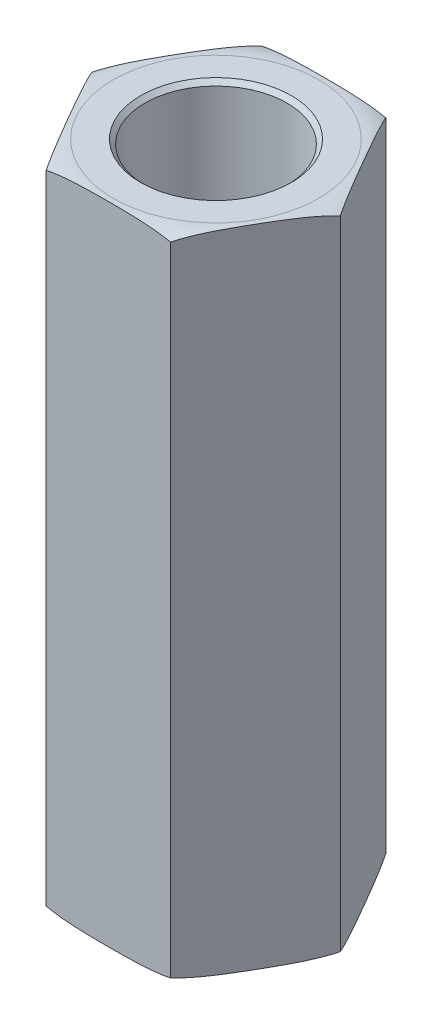
ISO-10303-21;
HEADER;
FILE_DESCRIPTION(('STEP AP214'),'2;1');
FILE_NAME('part.step','',(''),(''),'','','');
FILE_SCHEMA(('AUTOMOTIVE_DESIGN { 1 0 10303 214 1 1 1 1 }'));
ENDSEC;
DATA;
#1=APPLICATION_CONTEXT('core data for automotive mechanical design processes');
#2=APPLICATION_PROTOCOL_DEFINITION('international standard','automotive_design',2000,#1);
#3=PRODUCT_CONTEXT('',#1,'mechanical');
#4=PRODUCT('Part','Part','',(#3));
#5=PRODUCT_RELATED_PRODUCT_CATEGORY('part','',(#4));
#6=PRODUCT_DEFINITION_FORMATION('','',#4);
#7=PRODUCT_DEFINITION_CONTEXT('part definition',#1,'design');
#8=PRODUCT_DEFINITION('design','',#6,#7);
#9=PRODUCT_DEFINITION_SHAPE('','',#8);
#10=(LENGTH_UNIT() NAMED_UNIT(*) SI_UNIT(.MILLI.,.METRE.));
#11=(NAMED_UNIT(*) PLANE_ANGLE_UNIT() SI_UNIT($,.RADIAN.));
#12=(NAMED_UNIT(*) SI_UNIT($,.STERADIAN.) SOLID_ANGLE_UNIT());
#13=UNCERTAINTY_MEASURE_WITH_UNIT(LENGTH_MEASURE(1.E-05),#10,'distance_accuracy_value','');
#14=(GEOMETRIC_REPRESENTATION_CONTEXT(3) GLOBAL_UNCERTAINTY_ASSIGNED_CONTEXT((#13)) GLOBAL_UNIT_ASSIGNED_CONTEXT((#10,
#11,#12)) REPRESENTATION_CONTEXT('',''));
#15=CARTESIAN_POINT('',(0.,0.,0.));
#16=DIRECTION('',(0.,0.,1.));
#17=DIRECTION('',(1.,0.,0.));
#18=AXIS2_PLACEMENT_3D('',#15,#16,#17);
#19=CARTESIAN_POINT('',(3.66617420935412,9.525,0.));
#20=DIRECTION('',(-0.866025403784439,0.,0.5));
#21=DIRECTION('',(0.5,0.,0.866025403784439));
#22=AXIS2_PLACEMENT_3D('',#19,#20,#21);
#23=PLANE('',#22);
#24=CARTESIAN_POINT('',(3.66617420935412,9.398,0.));
#25=CARTESIAN_POINT('',(3.63753042799203,9.40993202468709,-0.0496124846400275));
#26=CARTESIAN_POINT('',(3.60875945805376,9.42055614694223,-0.0994452663561576));
#27=CARTESIAN_POINT('',(3.5510445941875,9.43952869380446,-0.199410342924434));
#28=CARTESIAN_POINT('',(3.52210079717004,9.44787829008084,-0.249542469922636));
#29=CARTESIAN_POINT('',(3.43520914920621,9.47001015084215,-0.400043218949384));
#30=CARTESIAN_POINT('',(3.37708055050429,9.48092253839952,-0.500724905273881));
#31=CARTESIAN_POINT('',(3.26070078255249,9.4975474670846,-0.702300576339476));
#32=CARTESIAN_POINT('',(3.20244972255356,9.50326351393611,-0.803194371852361));
#33=CARTESIAN_POINT('',(3.08586365366197,9.51154325238667,-1.00512736662733));
#34=CARTESIAN_POINT('',(3.02752861562773,9.5141051045623,-1.1061666163641));
#35=CARTESIAN_POINT('',(2.91138213832281,9.5174800878033,-1.30733821617637));
#36=CARTESIAN_POINT('',(2.85357078573453,9.51830898530758,-1.40747041611355));
#37=CARTESIAN_POINT('',(2.73795502274299,9.51890235146376,-1.60772279177072));
#38=CARTESIAN_POINT('',(2.68015061252642,9.51866697200316,-1.70784296716739));
#39=CARTESIAN_POINT('',(2.56452713843041,9.51693398748164,-1.9081086988493));
#40=CARTESIAN_POINT('',(2.50670807591217,9.51543597123025,-2.00825425277689));
#41=CARTESIAN_POINT('',(2.39109525560102,9.51017531674577,-2.20850153156214));
#42=CARTESIAN_POINT('',(2.33330149587798,9.50641290136093,-2.30860325976287));
#43=CARTESIAN_POINT('',(2.23849359853911,9.49698899303816,-2.47281535491256));
#44=CARTESIAN_POINT('',(2.20145192539195,9.49249057663768,-2.5369734148008));
#45=CARTESIAN_POINT('',(2.12747060706785,9.48130148199487,-2.66511281694908));
#46=CARTESIAN_POINT('',(2.09053091530161,9.47461207209161,-2.72909423990413));
#47=CARTESIAN_POINT('',(2.01669860633929,9.45839780386584,-2.85697555026699));
#48=CARTESIAN_POINT('',(1.97980639337021,9.44886525006224,-2.92087473753309));
#49=CARTESIAN_POINT('',(1.90623831426152,9.42626291445617,-3.04829838836459));
#50=CARTESIAN_POINT('',(1.86956287153406,9.41318767878213,-3.11182211855863));
#51=CARTESIAN_POINT('',(1.83308710467706,9.398,-3.175));
#52=B_SPLINE_CURVE_WITH_KNOTS('',3,(#24,#25,#26,#27,#28,#29,#30,#31,#32,#33,#34,#35,#36,#37,#38,
#39,#40,#41,#42,#43,#44,#45,#46,#47,#48,#49,#50,#51),.UNSPECIFIED.,.F.,.F.,(4,2,2,2,2,2,2,2,2,2,
2,2,2,4),(0.,0.17550946738822,0.350928353443244,0.701031261588482,1.05089779629354,
1.40096826525493,1.74783967758031,2.09466158796881,2.44159648808703,2.78849725058543,
3.0111319819994,3.23363806003511,3.45675194236245,3.68021127402553),.UNSPECIFIED.);
#53=CARTESIAN_POINT('',(3.66617420935412,9.398,0.));
#54=VERTEX_POINT('',#53);
#55=CARTESIAN_POINT('',(1.83308710467706,9.398,-3.175));
#56=VERTEX_POINT('',#55);
#57=EDGE_CURVE('E106',#54,#56,#52,.T.);
#58=ORIENTED_EDGE('',*,*,#57,.F.);
#59=DIRECTION('',(0.,1.,0.));
#60=VECTOR('',#59,1.);
#61=CARTESIAN_POINT('',(3.66617420935412,9.525,0.));
#62=LINE('',#61,#60);
#63=CARTESIAN_POINT('',(3.66617420935412,-9.398,0.));
#64=VERTEX_POINT('',#63);
#65=EDGE_CURVE('E79',#54,#64,#62,.F.);
#66=ORIENTED_EDGE('',*,*,#65,.T.);
#67=CARTESIAN_POINT('',(1.83308710467705,-9.398,-3.17500000000001));
#68=CARTESIAN_POINT('',(1.86173088603914,-9.40993202468709,-3.12538751535998));
#69=CARTESIAN_POINT('',(1.89050185597741,-9.42055614694223,-3.07555473364385));
#70=CARTESIAN_POINT('',(1.94821671984367,-9.43952869380445,-2.97558965707558));
#71=CARTESIAN_POINT('',(1.97716051686113,-9.44787829008084,-2.92545753007738));
#72=CARTESIAN_POINT('',(2.06405216482496,-9.47001015084215,-2.77495678105063));
#73=CARTESIAN_POINT('',(2.12218076352687,-9.48092253839952,-2.67427509472614));
#74=CARTESIAN_POINT('',(2.23856053147867,-9.4975474670846,-2.47269942366054));
#75=CARTESIAN_POINT('',(2.2968115914776,-9.50326351393611,-2.37180562814766));
#76=CARTESIAN_POINT('',(2.41339766036919,-9.51154325238667,-2.1698726333727));
#77=CARTESIAN_POINT('',(2.47173269840343,-9.5141051045623,-2.06883338363593));
#78=CARTESIAN_POINT('',(2.58787917570835,-9.5174800878033,-1.86766178382366));
#79=CARTESIAN_POINT('',(2.64569052829663,-9.51830898530758,-1.76752958388648));
#80=CARTESIAN_POINT('',(2.76130629128816,-9.51890235146376,-1.56727720822931));
#81=CARTESIAN_POINT('',(2.81911070150473,-9.51866697200316,-1.46715703283265));
#82=CARTESIAN_POINT('',(2.93473417560074,-9.51693398748165,-1.26689130115074));
#83=CARTESIAN_POINT('',(2.99255323811898,-9.51543597123026,-1.16674574722316));
#84=CARTESIAN_POINT('',(3.10816605843013,-9.51017531674577,-0.966498468437907));
#85=CARTESIAN_POINT('',(3.16595981815317,-9.50641290136093,-0.866396740237176));
#86=CARTESIAN_POINT('',(3.26076771549203,-9.49698899303816,-0.702184645087488));
#87=CARTESIAN_POINT('',(3.2978093886392,-9.49249057663768,-0.63802658519924));
#88=CARTESIAN_POINT('',(3.37179070696331,-9.48130148199488,-0.509887183050958));
#89=CARTESIAN_POINT('',(3.40873039872954,-9.47461207209161,-0.445905760095904));
#90=CARTESIAN_POINT('',(3.48256270769187,-9.45839780386584,-0.318024449733033));
#91=CARTESIAN_POINT('',(3.51945492066095,-9.44886525006225,-0.254125262466928));
#92=CARTESIAN_POINT('',(3.59302299976965,-9.42626291445618,-0.126701611635421));
#93=CARTESIAN_POINT('',(3.62969844249711,-9.41318767878214,-0.0631778814413773));
#94=CARTESIAN_POINT('',(3.66617420935412,-9.398,0.));
#95=B_SPLINE_CURVE_WITH_KNOTS('',3,(#67,#68,#69,#70,#71,#72,#73,#74,#75,#76,#77,#78,#79,#80,#81,
#82,#83,#84,#85,#86,#87,#88,#89,#90,#91,#92,#93,#94),.UNSPECIFIED.,.F.,.F.,(4,2,2,2,2,2,2,2,2,2,
2,2,2,4),(0.,0.175509467388216,0.350928353443236,0.701031261588468,1.05089779629352,
1.4009682652549,1.74783967758028,2.09466158796877,2.44159648808698,2.78849725058538,
3.01113198199936,3.23363806003509,3.45675194236244,3.68021127402553),.UNSPECIFIED.);
#96=CARTESIAN_POINT('',(1.83308710467705,-9.398,-3.175));
#97=VERTEX_POINT('',#96);
#98=EDGE_CURVE('E96',#97,#64,#95,.T.);
#99=ORIENTED_EDGE('',*,*,#98,.F.);
#100=DIRECTION('',(0.,1.,0.));
#101=VECTOR('',#100,1.);
#102=CARTESIAN_POINT('',(1.83308710467705,9.525,-3.175));
#103=LINE('',#102,#101);
#104=EDGE_CURVE('E110',#97,#56,#103,.T.);
#105=ORIENTED_EDGE('',*,*,#104,.T.);
#106=EDGE_LOOP('',(#58,#66,#99,#105));
#107=FACE_BOUND('',#106,.T.);
#108=ADVANCED_FACE('F16',(#107),#23,.F.);
#109=CARTESIAN_POINT('',(1.83308710467706,9.525,3.17499999999999));
#110=DIRECTION('',(-0.866025403784439,0.,-0.5));
#111=DIRECTION('',(-0.5,0.,0.866025403784439));
#112=AXIS2_PLACEMENT_3D('',#109,#110,#111);
#113=PLANE('',#112);
#114=CARTESIAN_POINT('',(1.83308710467706,9.398,3.17499999999999));
#115=CARTESIAN_POINT('',(1.86173088603915,9.40993202468709,3.12538751535996));
#116=CARTESIAN_POINT('',(1.89050185597743,9.42055614694223,3.07555473364383));
#117=CARTESIAN_POINT('',(1.94821671984368,9.43952869380446,2.97558965707556));
#118=CARTESIAN_POINT('',(1.97716051686114,9.44787829008084,2.92545753007735));
#119=CARTESIAN_POINT('',(2.06405216482498,9.47001015084215,2.77495678105061));
#120=CARTESIAN_POINT('',(2.12218076352689,9.48092253839952,2.67427509472611));
#121=CARTESIAN_POINT('',(2.23856053147869,9.4975474670846,2.47269942366051));
#122=CARTESIAN_POINT('',(2.29681159147762,9.50326351393611,2.37180562814763));
#123=CARTESIAN_POINT('',(2.41339766036921,9.51154325238667,2.16987263337266));
#124=CARTESIAN_POINT('',(2.47173269840345,9.5141051045623,2.06883338363589));
#125=CARTESIAN_POINT('',(2.58787917570837,9.5174800878033,1.86766178382362));
#126=CARTESIAN_POINT('',(2.64569052829666,9.51830898530758,1.76752958388644));
#127=CARTESIAN_POINT('',(2.76130629128819,9.51890235146376,1.56727720822927));
#128=CARTESIAN_POINT('',(2.81911070150476,9.51866697200316,1.4671570328326));
#129=CARTESIAN_POINT('',(2.93473417560078,9.51693398748164,1.26689130115069));
#130=CARTESIAN_POINT('',(2.99255323811901,9.51543597123025,1.1667457472231));
#131=CARTESIAN_POINT('',(3.10816605843017,9.51017531674577,0.966498468437848));
#132=CARTESIAN_POINT('',(3.16595981815321,9.50641290136093,0.866396740237115));
#133=CARTESIAN_POINT('',(3.26076771549207,9.49698899303816,0.702184645087431));
#134=CARTESIAN_POINT('',(3.29780938863923,9.49249057663768,0.638026585199189));
#135=CARTESIAN_POINT('',(3.37179070696333,9.48130148199487,0.509887183050919));
#136=CARTESIAN_POINT('',(3.40873039872956,9.47461207209161,0.44590576009587));
#137=CARTESIAN_POINT('',(3.48256270769188,9.45839780386584,0.31802444973301));
#138=CARTESIAN_POINT('',(3.51945492066096,9.44886525006224,0.254125262466912));
#139=CARTESIAN_POINT('',(3.59302299976965,9.42626291445617,0.126701611635416));
#140=CARTESIAN_POINT('',(3.62969844249711,9.41318767878213,0.0631778814413771));
#141=CARTESIAN_POINT('',(3.66617420935412,9.398,0.));
#142=B_SPLINE_CURVE_WITH_KNOTS('',3,(#114,#115,#116,#117,#118,#119,#120,#121,#122,#123,#124,
#125,#126,#127,#128,#129,#130,#131,#132,#133,#134,#135,#136,#137,#138,#139,#140,#141),
.UNSPECIFIED.,.F.,.F.,(4,2,2,2,2,2,2,2,2,2,2,2,2,4),(0.,0.17550946738822,0.350928353443244,
0.701031261588483,1.05089779629354,1.40096826525493,1.74783967758031,2.09466158796881,
2.44159648808703,2.78849725058544,3.01113198199939,3.2336380600351,3.45675194236244,
3.68021127402551),.UNSPECIFIED.);
#143=CARTESIAN_POINT('',(1.83308710467707,9.398,3.17499999999999));
#144=VERTEX_POINT('',#143);
#145=EDGE_CURVE('E21',#144,#54,#142,.T.);
#146=ORIENTED_EDGE('',*,*,#145,.F.);
#147=DIRECTION('',(0.,1.,0.));
#148=VECTOR('',#147,1.);
#149=CARTESIAN_POINT('',(1.83308710467707,9.525,3.17499999999999));
#150=LINE('',#149,#148);
#151=CARTESIAN_POINT('',(1.83308710467706,-9.398,3.17499999999999));
#152=VERTEX_POINT('',#151);
#153=EDGE_CURVE('E99',#144,#152,#150,.F.);
#154=ORIENTED_EDGE('',*,*,#153,.T.);
#155=CARTESIAN_POINT('',(3.66617420935412,-9.398,0.));
#156=CARTESIAN_POINT('',(3.63753042799203,-9.40993202468709,0.0496124846400324));
#157=CARTESIAN_POINT('',(3.60875945805375,-9.42055614694223,0.0994452663561624));
#158=CARTESIAN_POINT('',(3.5510445941875,-9.43952869380445,0.199410342924438));
#159=CARTESIAN_POINT('',(3.52210079717004,-9.44787829008084,0.24954246992264));
#160=CARTESIAN_POINT('',(3.43520914920621,-9.47001015084215,0.400043218949389));
#161=CARTESIAN_POINT('',(3.37708055050429,-9.48092253839952,0.500724905273886));
#162=CARTESIAN_POINT('',(3.26070078255249,-9.4975474670846,0.702300576339482));
#163=CARTESIAN_POINT('',(3.20244972255356,-9.50326351393611,0.803194371852367));
#164=CARTESIAN_POINT('',(3.08586365366197,-9.51154325238667,1.00512736662734));
#165=CARTESIAN_POINT('',(3.02752861562773,-9.5141051045623,1.1061666163641));
#166=CARTESIAN_POINT('',(2.91138213832281,-9.5174800878033,1.30733821617637));
#167=CARTESIAN_POINT('',(2.85357078573452,-9.51830898530758,1.40747041611356));
#168=CARTESIAN_POINT('',(2.73795502274299,-9.51890235146376,1.60772279177073));
#169=CARTESIAN_POINT('',(2.68015061252642,-9.51866697200316,1.70784296716739));
#170=CARTESIAN_POINT('',(2.5645271384304,-9.51693398748164,1.90810869884931));
#171=CARTESIAN_POINT('',(2.50670807591217,-9.51543597123025,2.00825425277689));
#172=CARTESIAN_POINT('',(2.39109525560101,-9.51017531674577,2.20850153156215));
#173=CARTESIAN_POINT('',(2.33330149587797,-9.50641290136093,2.30860325976288));
#174=CARTESIAN_POINT('',(2.23849359853911,-9.49698899303816,2.47281535491257));
#175=CARTESIAN_POINT('',(2.20145192539195,-9.49249057663768,2.53697341480081));
#176=CARTESIAN_POINT('',(2.12747060706785,-9.48130148199487,2.66511281694908));
#177=CARTESIAN_POINT('',(2.09053091530162,-9.47461207209161,2.72909423990413));
#178=CARTESIAN_POINT('',(2.0166986063393,-9.45839780386584,2.85697555026699));
#179=CARTESIAN_POINT('',(1.97980639337022,-9.44886525006225,2.92087473753308));
#180=CARTESIAN_POINT('',(1.90623831426153,-9.42626291445618,3.04829838836458));
#181=CARTESIAN_POINT('',(1.86956287153407,-9.41318767878214,3.11182211855862));
#182=CARTESIAN_POINT('',(1.83308710467706,-9.398,3.17499999999999));
#183=B_SPLINE_CURVE_WITH_KNOTS('',3,(#155,#156,#157,#158,#159,#160,#161,#162,#163,#164,#165,
#166,#167,#168,#169,#170,#171,#172,#173,#174,#175,#176,#177,#178,#179,#180,#181,#182),
.UNSPECIFIED.,.F.,.F.,(4,2,2,2,2,2,2,2,2,2,2,2,2,4),(0.,0.175509467388219,0.350928353443244,
0.701031261588483,1.05089779629354,1.40096826525493,1.74783967758031,2.09466158796881,
2.44159648808703,2.78849725058544,3.01113198199939,3.2336380600351,3.45675194236244,
3.68021127402551),.UNSPECIFIED.);
#184=EDGE_CURVE('E204',#64,#152,#183,.T.);
#185=ORIENTED_EDGE('',*,*,#184,.F.);
#186=ORIENTED_EDGE('',*,*,#65,.F.);
#187=EDGE_LOOP('',(#146,#154,#185,#186));
#188=FACE_BOUND('',#187,.T.);
#189=ADVANCED_FACE('F105',(#188),#113,.F.);
#190=CARTESIAN_POINT('',(-1.83308710467707,9.525,3.175));
#191=DIRECTION('',(0.,0.,-1.));
#192=DIRECTION('',(-1.,0.,0.));
#193=AXIS2_PLACEMENT_3D('',#190,#191,#192);
#194=PLANE('',#193);
#195=ORIENTED_EDGE('',*,*,#153,.F.);
#196=CARTESIAN_POINT('',(-1.83308710467707,9.39799999999999,3.175));
#197=CARTESIAN_POINT('',(-1.75760871054776,9.41371230122365,3.175));
#198=CARTESIAN_POINT('',(-1.68170571468658,9.4271647800808,3.175));
#199=CARTESIAN_POINT('',(-1.52939807527773,9.45030486470105,3.175));
#200=CARTESIAN_POINT('',(-1.45299400110163,9.45999617502722,3.175));
#201=CARTESIAN_POINT('',(-1.30011823209763,9.47637135267139,3.175));
#202=CARTESIAN_POINT('',(-1.22364747610196,9.48306442247852,3.175));
#203=CARTESIAN_POINT('',(-1.07052459410173,9.49417241699752,3.175));
#204=CARTESIAN_POINT('',(-0.993872424115956,9.49858671655426,3.175));
#205=CARTESIAN_POINT('',(-0.840856910195845,9.50572419802799,3.175));
#206=CARTESIAN_POINT('',(-0.764493913329281,9.50845527367792,3.175));
#207=CARTESIAN_POINT('',(-0.611734616938516,9.51275632258004,3.175));
#208=CARTESIAN_POINT('',(-0.535338316331409,9.51432625473884,3.175));
#209=CARTESIAN_POINT('',(-0.38245423122642,9.51668247076568,3.175));
#210=CARTESIAN_POINT('',(-0.305966435115039,9.51746792759645,3.175));
#211=CARTESIAN_POINT('',(-0.152985759387012,9.51848841069005,3.175));
#212=CARTESIAN_POINT('',(-0.076492879693506,9.51872342414921,3.175));
#213=CARTESIAN_POINT('',(0.0764928796935065,9.51872342414921,3.175));
#214=CARTESIAN_POINT('',(0.152985759387013,9.51848841069005,3.17499999999999));
#215=CARTESIAN_POINT('',(0.305966435115039,9.51746792759645,3.17499999999999));
#216=CARTESIAN_POINT('',(0.38245423122642,9.51668247076568,3.17499999999999));
#217=CARTESIAN_POINT('',(0.535338316331409,9.51432625473884,3.17499999999999));
#218=CARTESIAN_POINT('',(0.611734616938516,9.51275632258004,3.17499999999999));
#219=CARTESIAN_POINT('',(0.764493913329281,9.50845527367792,3.17499999999999));
#220=CARTESIAN_POINT('',(0.840856910195845,9.50572419802799,3.17499999999999));
#221=CARTESIAN_POINT('',(0.993872424115955,9.49858671655426,3.17499999999999));
#222=CARTESIAN_POINT('',(1.07052459410172,9.49417241699752,3.17499999999999));
#223=CARTESIAN_POINT('',(1.22364747610196,9.48306442247852,3.17499999999999));
#224=CARTESIAN_POINT('',(1.30011823209763,9.47637135267139,3.17499999999999));
#225=CARTESIAN_POINT('',(1.45299400110163,9.45999617502723,3.17499999999999));
#226=CARTESIAN_POINT('',(1.52939807527773,9.45030486470105,3.17499999999999));
#227=CARTESIAN_POINT('',(1.68170571468658,9.42716478008081,3.17499999999999));
#228=CARTESIAN_POINT('',(1.75760871054776,9.41371230122365,3.17499999999999));
#229=CARTESIAN_POINT('',(1.83308710467707,9.398,3.17499999999999));
#230=B_SPLINE_CURVE_WITH_KNOTS('',3,(#196,#197,#198,#199,#200,#201,#202,#203,#204,#205,#206,
#207,#208,#209,#210,#211,#212,#213,#214,#215,#216,#217,#218,#219,#220,#221,#222,#223,#224,#225,
#226,#227,#228,#229),.UNSPECIFIED.,.F.,.F.,(4,2,2,2,2,2,2,2,2,2,2,2,2,2,2,2,4),(0.,
0.23119079437731,0.46215329593589,0.692401964780504,0.922713766248053,1.15193709952408,
1.3811685447265,1.61064140410055,1.84011960111017,2.06959779811978,2.29907065749383,
2.52830210269626,2.75752543597228,2.98783723743982,3.21808590628444,3.44904840784302,
3.68023920222033),.UNSPECIFIED.);
#231=CARTESIAN_POINT('',(-1.83308710467707,9.398,3.175));
#232=VERTEX_POINT('',#231);
#233=EDGE_CURVE('E85',#232,#144,#230,.T.);
#234=ORIENTED_EDGE('',*,*,#233,.F.);
#235=DIRECTION('',(0.,1.,0.));
#236=VECTOR('',#235,1.);
#237=CARTESIAN_POINT('',(-1.83308710467707,9.525,3.175));
#238=LINE('',#237,#236);
#239=CARTESIAN_POINT('',(-1.83308710467707,-9.398,3.175));
#240=VERTEX_POINT('',#239);
#241=EDGE_CURVE('E103',#232,#240,#238,.F.);
#242=ORIENTED_EDGE('',*,*,#241,.T.);
#243=CARTESIAN_POINT('',(1.83308710467706,-9.398,3.17499999999999));
#244=CARTESIAN_POINT('',(1.75760871054776,-9.41371230122365,3.17499999999999));
#245=CARTESIAN_POINT('',(1.68170571468658,-9.42716478008081,3.17499999999999));
#246=CARTESIAN_POINT('',(1.52939807527773,-9.45030486470105,3.17499999999999));
#247=CARTESIAN_POINT('',(1.45299400110163,-9.45999617502723,3.17499999999999));
#248=CARTESIAN_POINT('',(1.30011823209763,-9.47637135267139,3.17499999999999));
#249=CARTESIAN_POINT('',(1.22364747610196,-9.48306442247852,3.17499999999999));
#250=CARTESIAN_POINT('',(1.07052459410172,-9.49417241699752,3.17499999999999));
#251=CARTESIAN_POINT('',(0.993872424115954,-9.49858671655426,3.17499999999999));
#252=CARTESIAN_POINT('',(0.840856910195844,-9.50572419802799,3.17499999999999));
#253=CARTESIAN_POINT('',(0.76449391332928,-9.50845527367792,3.17499999999999));
#254=CARTESIAN_POINT('',(0.611734616938514,-9.51275632258004,3.17499999999999));
#255=CARTESIAN_POINT('',(0.535338316331408,-9.51432625473884,3.17499999999999));
#256=CARTESIAN_POINT('',(0.382454231226419,-9.51668247076568,3.17499999999999));
#257=CARTESIAN_POINT('',(0.305966435115038,-9.51746792759645,3.17499999999999));
#258=CARTESIAN_POINT('',(0.152985759387012,-9.51848841069005,3.17499999999999));
#259=CARTESIAN_POINT('',(0.076492879693506,-9.51872342414921,3.175));
#260=CARTESIAN_POINT('',(-0.0764928796935062,-9.51872342414921,3.175));
#261=CARTESIAN_POINT('',(-0.152985759387012,-9.51848841069005,3.175));
#262=CARTESIAN_POINT('',(-0.305966435115038,-9.51746792759645,3.175));
#263=CARTESIAN_POINT('',(-0.382454231226419,-9.51668247076568,3.175));
#264=CARTESIAN_POINT('',(-0.535338316331408,-9.51432625473884,3.175));
#265=CARTESIAN_POINT('',(-0.611734616938515,-9.51275632258004,3.175));
#266=CARTESIAN_POINT('',(-0.76449391332928,-9.50845527367792,3.175));
#267=CARTESIAN_POINT('',(-0.840856910195844,-9.50572419802799,3.175));
#268=CARTESIAN_POINT('',(-0.993872424115954,-9.49858671655426,3.175));
#269=CARTESIAN_POINT('',(-1.07052459410172,-9.49417241699752,3.175));
#270=CARTESIAN_POINT('',(-1.22364747610196,-9.48306442247852,3.175));
#271=CARTESIAN_POINT('',(-1.30011823209763,-9.47637135267139,3.175));
#272=CARTESIAN_POINT('',(-1.45299400110163,-9.45999617502722,3.175));
#273=CARTESIAN_POINT('',(-1.52939807527773,-9.45030486470105,3.175));
#274=CARTESIAN_POINT('',(-1.68170571468658,-9.4271647800808,3.175));
#275=CARTESIAN_POINT('',(-1.75760871054776,-9.41371230122365,3.175));
#276=CARTESIAN_POINT('',(-1.83308710467706,-9.398,3.175));
#277=B_SPLINE_CURVE_WITH_KNOTS('',3,(#243,#244,#245,#246,#247,#248,#249,#250,#251,#252,#253,
#254,#255,#256,#257,#258,#259,#260,#261,#262,#263,#264,#265,#266,#267,#268,#269,#270,#271,#272,
#273,#274,#275,#276),.UNSPECIFIED.,.F.,.F.,(4,2,2,2,2,2,2,2,2,2,2,2,2,2,2,2,4),(0.,
0.23119079437731,0.462153295935889,0.692401964780503,0.922713766248051,1.15193709952407,
1.3811685447265,1.61064140410055,1.84011960111016,2.06959779811977,2.29907065749383,
2.52830210269625,2.75752543597227,2.98783723743982,3.21808590628443,3.44904840784301,
3.68023920222032),.UNSPECIFIED.);
#278=EDGE_CURVE('E101',#152,#240,#277,.T.);
#279=ORIENTED_EDGE('',*,*,#278,.F.);
#280=EDGE_LOOP('',(#195,#234,#242,#279));
#281=FACE_BOUND('',#280,.T.);
#282=ADVANCED_FACE('F100',(#281),#194,.F.);
#283=CARTESIAN_POINT('',(-3.66617420935413,9.525,0.));
#284=DIRECTION('',(0.866025403784439,0.,-0.499999999999999));
#285=DIRECTION('',(-0.499999999999999,0.,-0.866025403784439));
#286=AXIS2_PLACEMENT_3D('',#283,#284,#285);
#287=PLANE('',#286);
#288=CARTESIAN_POINT('',(-3.66617420935412,9.39799999999999,0.));
#289=CARTESIAN_POINT('',(-3.63753042799204,9.40993202468708,0.0496124846400222));
#290=CARTESIAN_POINT('',(-3.60875945805377,9.42055614694222,0.0994452663561455));
#291=CARTESIAN_POINT('',(-3.55104459418752,9.43952869380445,0.199410342924408));
#292=CARTESIAN_POINT('',(-3.52210079717006,9.44787829008083,0.249542469922603));
#293=CARTESIAN_POINT('',(-3.43520914920624,9.47001015084215,0.400043218949332));
#294=CARTESIAN_POINT('',(-3.37708055050434,9.48092253839951,0.500724905273816));
#295=CARTESIAN_POINT('',(-3.26070078255255,9.4975474670846,0.702300576339384));
#296=CARTESIAN_POINT('',(-3.20244972255363,9.50326351393611,0.803194371852256));
#297=CARTESIAN_POINT('',(-3.08586365366205,9.51154325238667,1.0051273666272));
#298=CARTESIAN_POINT('',(-3.02752861562782,9.5141051045623,1.10616661636395));
#299=CARTESIAN_POINT('',(-2.91138213832292,9.5174800878033,1.30733821617619));
#300=CARTESIAN_POINT('',(-2.85357078573464,9.51830898530758,1.40747041611336));
#301=CARTESIAN_POINT('',(-2.73795502274313,9.51890235146376,1.60772279177051));
#302=CARTESIAN_POINT('',(-2.68015061252656,9.51866697200317,1.70784296716716));
#303=CARTESIAN_POINT('',(-2.56452713843056,9.51693398748165,1.90810869884905));
#304=CARTESIAN_POINT('',(-2.50670807591233,9.51543597123026,2.00825425277662));
#305=CARTESIAN_POINT('',(-2.39109525560119,9.51017531674578,2.20850153156185));
#306=CARTESIAN_POINT('',(-2.33330149587816,9.50641290136095,2.30860325976257));
#307=CARTESIAN_POINT('',(-2.23849359853929,9.49698899303818,2.47281535491227));
#308=CARTESIAN_POINT('',(-2.20145192539211,9.4924905766377,2.53697341480054));
#309=CARTESIAN_POINT('',(-2.12747060706798,9.48130148199489,2.66511281694887));
#310=CARTESIAN_POINT('',(-2.09053091530173,9.47461207209163,2.72909423990394));
#311=CARTESIAN_POINT('',(-2.01669860633938,9.45839780386585,2.85697555026686));
#312=CARTESIAN_POINT('',(-1.97980639337028,9.44886525006226,2.92087473753298));
#313=CARTESIAN_POINT('',(-1.90623831426156,9.42626291445618,3.04829838836453));
#314=CARTESIAN_POINT('',(-1.86956287153409,9.41318767878214,3.1118221185586));
#315=CARTESIAN_POINT('',(-1.83308710467707,9.39799999999999,3.175));
#316=B_SPLINE_CURVE_WITH_KNOTS('',3,(#288,#289,#290,#291,#292,#293,#294,#295,#296,#297,#298,
#299,#300,#301,#302,#303,#304,#305,#306,#307,#308,#309,#310,#311,#312,#313,#314,#315),
.UNSPECIFIED.,.F.,.F.,(4,2,2,2,2,2,2,2,2,2,2,2,2,4),(0.,0.175509467388196,0.350928353443197,
0.70103126158839,1.0508977962934,1.40096826525474,1.74783967758008,2.09466158796853,
2.4415964880867,2.78849725058507,3.01113198199912,3.23363806003492,3.45675194236235,
3.68021127402552),.UNSPECIFIED.);
#317=CARTESIAN_POINT('',(-3.66617420935413,9.39799999999999,0.));
#318=VERTEX_POINT('',#317);
#319=EDGE_CURVE('E93',#318,#232,#316,.T.);
#320=ORIENTED_EDGE('',*,*,#319,.F.);
#321=DIRECTION('',(0.,1.,0.));
#322=VECTOR('',#321,1.);
#323=CARTESIAN_POINT('',(-3.66617420935413,9.525,0.));
#324=LINE('',#323,#322);
#325=CARTESIAN_POINT('',(-3.66617420935413,-9.398,0.));
#326=VERTEX_POINT('',#325);
#327=EDGE_CURVE('E117',#318,#326,#324,.F.);
#328=ORIENTED_EDGE('',*,*,#327,.T.);
#329=CARTESIAN_POINT('',(-1.83308710467707,-9.39799999999999,3.175));
#330=CARTESIAN_POINT('',(-1.86173088603915,-9.40993202468708,3.12538751535998));
#331=CARTESIAN_POINT('',(-1.89050185597742,-9.42055614694222,3.07555473364385));
#332=CARTESIAN_POINT('',(-1.94821671984367,-9.43952869380445,2.97558965707558));
#333=CARTESIAN_POINT('',(-1.97716051686113,-9.44787829008083,2.92545753007739));
#334=CARTESIAN_POINT('',(-2.06405216482496,-9.47001015084215,2.77495678105065));
#335=CARTESIAN_POINT('',(-2.12218076352686,-9.48092253839952,2.67427509472617));
#336=CARTESIAN_POINT('',(-2.23856053147865,-9.4975474670846,2.47269942366059));
#337=CARTESIAN_POINT('',(-2.29681159147757,-9.50326351393611,2.37180562814772));
#338=CARTESIAN_POINT('',(-2.41339766036916,-9.51154325238667,2.16987263337277));
#339=CARTESIAN_POINT('',(-2.47173269840339,-9.5141051045623,2.06883338363601));
#340=CARTESIAN_POINT('',(-2.5878791757083,-9.5174800878033,1.86766178382376));
#341=CARTESIAN_POINT('',(-2.64569052829658,-9.51830898530758,1.76752958388659));
#342=CARTESIAN_POINT('',(-2.7613062912881,-9.51890235146376,1.56727720822944));
#343=CARTESIAN_POINT('',(-2.81911070150467,-9.51866697200316,1.46715703283278));
#344=CARTESIAN_POINT('',(-2.93473417560067,-9.51693398748165,1.26689130115088));
#345=CARTESIAN_POINT('',(-2.9925532381189,-9.51543597123026,1.16674574722331));
#346=CARTESIAN_POINT('',(-3.10816605843004,-9.51017531674578,0.966498468438076));
#347=CARTESIAN_POINT('',(-3.16595981815307,-9.50641290136094,0.866396740237353));
#348=CARTESIAN_POINT('',(-3.26076771549194,-9.49698899303818,0.702184645087658));
#349=CARTESIAN_POINT('',(-3.29780938863912,-9.49249057663769,0.638026585199395));
#350=CARTESIAN_POINT('',(-3.37179070696324,-9.48130148199489,0.509887183051082));
#351=CARTESIAN_POINT('',(-3.40873039872949,-9.47461207209162,0.445905760096013));
#352=CARTESIAN_POINT('',(-3.48256270769183,-9.45839780386585,0.318024449733112));
#353=CARTESIAN_POINT('',(-3.51945492066092,-9.44886525006225,0.254125262466993));
#354=CARTESIAN_POINT('',(-3.59302299976963,-9.42626291445618,0.126701611635455));
#355=CARTESIAN_POINT('',(-3.6296984424971,-9.41318767878214,0.0631778814413959));
#356=CARTESIAN_POINT('',(-3.66617420935412,-9.398,0.));
#357=B_SPLINE_CURVE_WITH_KNOTS('',3,(#329,#330,#331,#332,#333,#334,#335,#336,#337,#338,#339,
#340,#341,#342,#343,#344,#345,#346,#347,#348,#349,#350,#351,#352,#353,#354,#355,#356),
.UNSPECIFIED.,.F.,.F.,(4,2,2,2,2,2,2,2,2,2,2,2,2,4),(0.,0.175509467388203,0.350928353443209,
0.701031261588413,1.05089779629344,1.40096826525479,1.74783967758014,2.0946615879686,
2.44159648808678,2.78849725058516,3.01113198199919,3.23363806003497,3.45675194236238,
3.68021127402552),.UNSPECIFIED.);
#358=EDGE_CURVE('E195',#240,#326,#357,.T.);
#359=ORIENTED_EDGE('',*,*,#358,.F.);
#360=ORIENTED_EDGE('',*,*,#241,.F.);
#361=EDGE_LOOP('',(#320,#328,#359,#360));
#362=FACE_BOUND('',#361,.T.);
#363=ADVANCED_FACE('F189',(#362),#287,.F.);
#364=CARTESIAN_POINT('',(-1.83308710467707,9.525,-3.175));
#365=DIRECTION('',(0.866025403784439,0.,0.5));
#366=DIRECTION('',(0.5,0.,-0.866025403784439));
#367=AXIS2_PLACEMENT_3D('',#364,#365,#366);
#368=PLANE('',#367);
#369=CARTESIAN_POINT('',(-1.83308710467706,9.39799999999999,-3.17500000000001));
#370=CARTESIAN_POINT('',(-1.86173088603915,9.40993202468708,-3.12538751535999));
#371=CARTESIAN_POINT('',(-1.89050185597742,9.42055614694222,-3.07555473364386));
#372=CARTESIAN_POINT('',(-1.94821671984366,9.43952869380445,-2.9755896570756));
#373=CARTESIAN_POINT('',(-1.97716051686112,9.44787829008083,-2.92545753007741));
#374=CARTESIAN_POINT('',(-2.06405216482494,9.47001015084215,-2.77495678105068));
#375=CARTESIAN_POINT('',(-2.12218076352685,9.48092253839951,-2.6742750947262));
#376=CARTESIAN_POINT('',(-2.23856053147863,9.4975474670846,-2.47269942366064));
#377=CARTESIAN_POINT('',(-2.29681159147755,9.50326351393611,-2.37180562814777));
#378=CARTESIAN_POINT('',(-2.41339766036912,9.51154325238667,-2.16987263337283));
#379=CARTESIAN_POINT('',(-2.47173269840336,9.5141051045623,-2.06883338363608));
#380=CARTESIAN_POINT('',(-2.58787917570826,9.5174800878033,-1.86766178382384));
#381=CARTESIAN_POINT('',(-2.64569052829653,9.51830898530758,-1.76752958388667));
#382=CARTESIAN_POINT('',(-2.76130629128805,9.51890235146376,-1.56727720822953));
#383=CARTESIAN_POINT('',(-2.81911070150462,9.51866697200317,-1.46715703283288));
#384=CARTESIAN_POINT('',(-2.93473417560061,9.51693398748165,-1.26689130115099));
#385=CARTESIAN_POINT('',(-2.99255323811884,9.51543597123026,-1.16674574722342));
#386=CARTESIAN_POINT('',(-3.10816605842998,9.51017531674579,-0.966498468438198));
#387=CARTESIAN_POINT('',(-3.16595981815301,9.50641290136095,-0.86639674023748));
#388=CARTESIAN_POINT('',(-3.26076771549188,9.49698899303819,-0.702184645087778));
#389=CARTESIAN_POINT('',(-3.29780938863906,9.4924905766377,-0.638026585199504));
#390=CARTESIAN_POINT('',(-3.3717907069632,9.4813014819949,-0.50988718305117));
#391=CARTESIAN_POINT('',(-3.40873039872945,9.47461207209163,-0.44590576009609));
#392=CARTESIAN_POINT('',(-3.4825627076918,9.45839780386586,-0.318024449733166));
#393=CARTESIAN_POINT('',(-3.5194549206609,9.44886525006226,-0.254125262467035));
#394=CARTESIAN_POINT('',(-3.59302299976963,9.42626291445618,-0.126701611635476));
#395=CARTESIAN_POINT('',(-3.6296984424971,9.41318767878213,-0.0631778814414058));
#396=CARTESIAN_POINT('',(-3.66617420935413,9.39799999999999,0.));
#397=B_SPLINE_CURVE_WITH_KNOTS('',3,(#369,#370,#371,#372,#373,#374,#375,#376,#377,#378,#379,
#380,#381,#382,#383,#384,#385,#386,#387,#388,#389,#390,#391,#392,#393,#394,#395,#396),
.UNSPECIFIED.,.F.,.F.,(4,2,2,2,2,2,2,2,2,2,2,2,2,4),(0.,0.175509467388193,0.350928353443191,
0.701031261588377,1.05089779629338,1.40096826525472,1.74783967758005,2.0946615879685,
2.44159648808666,2.78849725058502,3.01113198199908,3.2336380600349,3.45675194236235,
3.68021127402553),.UNSPECIFIED.);
#398=CARTESIAN_POINT('',(-1.83308710467706,9.398,-3.175));
#399=VERTEX_POINT('',#398);
#400=EDGE_CURVE('E165',#399,#318,#397,.T.);
#401=ORIENTED_EDGE('',*,*,#400,.F.);
#402=DIRECTION('',(0.,1.,0.));
#403=VECTOR('',#402,1.);
#404=CARTESIAN_POINT('',(-1.83308710467706,9.525,-3.175));
#405=LINE('',#404,#403);
#406=CARTESIAN_POINT('',(-1.83308710467707,-9.39799999999999,-3.175));
#407=VERTEX_POINT('',#406);
#408=EDGE_CURVE('E107',#399,#407,#405,.F.);
#409=ORIENTED_EDGE('',*,*,#408,.T.);
#410=CARTESIAN_POINT('',(-3.66617420935413,-9.39799999999999,0.));
#411=CARTESIAN_POINT('',(-3.63753042799204,-9.40993202468708,-0.0496124846400259));
#412=CARTESIAN_POINT('',(-3.60875945805377,-9.42055614694222,-0.0994452663561509));
#413=CARTESIAN_POINT('',(-3.55104459418752,-9.43952869380445,-0.199410342924416));
#414=CARTESIAN_POINT('',(-3.52210079717006,-9.44787829008083,-0.249542469922613));
#415=CARTESIAN_POINT('',(-3.43520914920624,-9.47001015084215,-0.400043218949346));
#416=CARTESIAN_POINT('',(-3.37708055050433,-9.48092253839952,-0.500724905273833));
#417=CARTESIAN_POINT('',(-3.26070078255254,-9.4975474670846,-0.702300576339408));
#418=CARTESIAN_POINT('',(-3.20244972255362,-9.50326351393611,-0.803194371852283));
#419=CARTESIAN_POINT('',(-3.08586365366204,-9.51154325238667,-1.00512736662723));
#420=CARTESIAN_POINT('',(-3.0275286156278,-9.5141051045623,-1.10616661636399));
#421=CARTESIAN_POINT('',(-2.91138213832289,-9.5174800878033,-1.30733821617624));
#422=CARTESIAN_POINT('',(-2.85357078573462,-9.51830898530758,-1.40747041611341));
#423=CARTESIAN_POINT('',(-2.7379550227431,-9.51890235146376,-1.60772279177056));
#424=CARTESIAN_POINT('',(-2.68015061252653,-9.51866697200316,-1.70784296716722));
#425=CARTESIAN_POINT('',(-2.56452713843053,-9.51693398748165,-1.90810869884911));
#426=CARTESIAN_POINT('',(-2.5067080759123,-9.51543597123026,-2.00825425277669));
#427=CARTESIAN_POINT('',(-2.39109525560115,-9.51017531674578,-2.20850153156192));
#428=CARTESIAN_POINT('',(-2.33330149587812,-9.50641290136094,-2.30860325976265));
#429=CARTESIAN_POINT('',(-2.23849359853925,-9.49698899303818,-2.47281535491234));
#430=CARTESIAN_POINT('',(-2.20145192539208,-9.49249057663769,-2.53697341480061));
#431=CARTESIAN_POINT('',(-2.12747060706795,-9.48130148199489,-2.66511281694892));
#432=CARTESIAN_POINT('',(-2.09053091530171,-9.47461207209162,-2.72909423990399));
#433=CARTESIAN_POINT('',(-2.01669860633936,-9.45839780386585,-2.85697555026689));
#434=CARTESIAN_POINT('',(-1.97980639337027,-9.44886525006225,-2.92087473753301));
#435=CARTESIAN_POINT('',(-1.90623831426156,-9.42626291445618,-3.04829838836455));
#436=CARTESIAN_POINT('',(-1.86956287153409,-9.41318767878213,-3.11182211855861));
#437=CARTESIAN_POINT('',(-1.83308710467707,-9.39799999999999,-3.175));
#438=B_SPLINE_CURVE_WITH_KNOTS('',3,(#410,#411,#412,#413,#414,#415,#416,#417,#418,#419,#420,
#421,#422,#423,#424,#425,#426,#427,#428,#429,#430,#431,#432,#433,#434,#435,#436,#437),
.UNSPECIFIED.,.F.,.F.,(4,2,2,2,2,2,2,2,2,2,2,2,2,4),(0.,0.175509467388202,0.350928353443208,
0.701031261588412,1.05089779629344,1.40096826525479,1.74783967758014,2.0946615879686,
2.44159648808678,2.78849725058516,3.01113198199919,3.23363806003497,3.45675194236238,
3.68021127402553),.UNSPECIFIED.);
#439=EDGE_CURVE('E141',#326,#407,#438,.T.);
#440=ORIENTED_EDGE('',*,*,#439,.F.);
#441=ORIENTED_EDGE('',*,*,#327,.F.);
#442=EDGE_LOOP('',(#401,#409,#440,#441));
#443=FACE_BOUND('',#442,.T.);
#444=ADVANCED_FACE('F151',(#443),#368,.F.);
#445=CARTESIAN_POINT('',(1.83308710467706,9.525,-3.175));
#446=DIRECTION('',(0.,0.,1.));
#447=DIRECTION('',(1.,0.,0.));
#448=AXIS2_PLACEMENT_3D('',#445,#446,#447);
#449=PLANE('',#448);
#450=CARTESIAN_POINT('',(1.83308710467705,9.398,-3.175));
#451=CARTESIAN_POINT('',(1.75760871054775,9.41371230122365,-3.175));
#452=CARTESIAN_POINT('',(1.68170571468657,9.4271647800808,-3.175));
#453=CARTESIAN_POINT('',(1.52939807527772,9.45030486470105,-3.175));
#454=CARTESIAN_POINT('',(1.45299400110162,9.45999617502722,-3.175));
#455=CARTESIAN_POINT('',(1.30011823209763,9.47637135267139,-3.175));
#456=CARTESIAN_POINT('',(1.22364747610195,9.48306442247852,-3.175));
#457=CARTESIAN_POINT('',(1.07052459410172,9.49417241699752,-3.175));
#458=CARTESIAN_POINT('',(0.99387242411595,9.49858671655426,-3.175));
#459=CARTESIAN_POINT('',(0.84085691019584,9.50572419802799,-3.175));
#460=CARTESIAN_POINT('',(0.764493913329277,9.50845527367792,-3.175));
#461=CARTESIAN_POINT('',(0.611734616938512,9.51275632258004,-3.175));
#462=CARTESIAN_POINT('',(0.535338316331406,9.51432625473884,-3.175));
#463=CARTESIAN_POINT('',(0.382454231226418,9.51668247076568,-3.175));
#464=CARTESIAN_POINT('',(0.305966435115037,9.51746792759645,-3.175));
#465=CARTESIAN_POINT('',(0.152985759387012,9.51848841069005,-3.175));
#466=CARTESIAN_POINT('',(0.0764928796935062,9.51872342414921,-3.175));
#467=CARTESIAN_POINT('',(-0.0764928796935054,9.51872342414921,-3.175));
#468=CARTESIAN_POINT('',(-0.152985759387011,9.51848841069005,-3.175));
#469=CARTESIAN_POINT('',(-0.305966435115037,9.51746792759645,-3.175));
#470=CARTESIAN_POINT('',(-0.382454231226418,9.51668247076568,-3.175));
#471=CARTESIAN_POINT('',(-0.535338316331406,9.51432625473884,-3.175));
#472=CARTESIAN_POINT('',(-0.611734616938512,9.51275632258004,-3.175));
#473=CARTESIAN_POINT('',(-0.764493913329277,9.50845527367792,-3.175));
#474=CARTESIAN_POINT('',(-0.840856910195841,9.50572419802799,-3.175));
#475=CARTESIAN_POINT('',(-0.99387242411595,9.49858671655426,-3.175));
#476=CARTESIAN_POINT('',(-1.07052459410172,9.49417241699752,-3.175));
#477=CARTESIAN_POINT('',(-1.22364747610195,9.48306442247852,-3.175));
#478=CARTESIAN_POINT('',(-1.30011823209763,9.47637135267139,-3.175));
#479=CARTESIAN_POINT('',(-1.45299400110163,9.45999617502722,-3.175));
#480=CARTESIAN_POINT('',(-1.52939807527772,9.45030486470105,-3.175));
#481=CARTESIAN_POINT('',(-1.68170571468657,9.4271647800808,-3.175));
#482=CARTESIAN_POINT('',(-1.75760871054775,9.41371230122365,-3.175));
#483=CARTESIAN_POINT('',(-1.83308710467706,9.39799999999999,-3.175));
#484=B_SPLINE_CURVE_WITH_KNOTS('',3,(#450,#451,#452,#453,#454,#455,#456,#457,#458,#459,#460,
#461,#462,#463,#464,#465,#466,#467,#468,#469,#470,#471,#472,#473,#474,#475,#476,#477,#478,#479,
#480,#481,#482,#483),.UNSPECIFIED.,.F.,.F.,(4,2,2,2,2,2,2,2,2,2,2,2,2,2,2,2,4),(0.,
0.231190794377309,0.462153295935887,0.6924019647805,0.922713766248047,1.15193709952407,
1.38116854472649,1.61064140410054,1.84011960111015,2.06959779811976,2.29907065749382,
2.52830210269624,2.75752543597226,2.98783723743981,3.21808590628442,3.449048407843,
3.68023920222031),.UNSPECIFIED.);
#485=EDGE_CURVE('E108',#56,#399,#484,.T.);
#486=ORIENTED_EDGE('',*,*,#485,.F.);
#487=ORIENTED_EDGE('',*,*,#104,.F.);
#488=CARTESIAN_POINT('',(-1.83308710467707,-9.39799999999999,-3.175));
#489=CARTESIAN_POINT('',(-1.75760871054776,-9.41371230122365,-3.175));
#490=CARTESIAN_POINT('',(-1.68170571468658,-9.4271647800808,-3.175));
#491=CARTESIAN_POINT('',(-1.52939807527773,-9.45030486470105,-3.175));
#492=CARTESIAN_POINT('',(-1.45299400110163,-9.45999617502722,-3.175));
#493=CARTESIAN_POINT('',(-1.30011823209763,-9.47637135267139,-3.175));
#494=CARTESIAN_POINT('',(-1.22364747610196,-9.48306442247852,-3.175));
#495=CARTESIAN_POINT('',(-1.07052459410173,-9.49417241699752,-3.175));
#496=CARTESIAN_POINT('',(-0.993872424115956,-9.49858671655426,-3.175));
#497=CARTESIAN_POINT('',(-0.840856910195846,-9.50572419802799,-3.175));
#498=CARTESIAN_POINT('',(-0.764493913329282,-9.50845527367792,-3.175));
#499=CARTESIAN_POINT('',(-0.611734616938516,-9.51275632258004,-3.175));
#500=CARTESIAN_POINT('',(-0.535338316331409,-9.51432625473884,-3.175));
#501=CARTESIAN_POINT('',(-0.38245423122642,-9.51668247076568,-3.175));
#502=CARTESIAN_POINT('',(-0.305966435115039,-9.51746792759645,-3.175));
#503=CARTESIAN_POINT('',(-0.152985759387013,-9.51848841069005,-3.175));
#504=CARTESIAN_POINT('',(-0.0764928796935069,-9.51872342414921,-3.175));
#505=CARTESIAN_POINT('',(0.0764928796935047,-9.51872342414921,-3.175));
#506=CARTESIAN_POINT('',(0.15298575938701,-9.51848841069005,-3.175));
#507=CARTESIAN_POINT('',(0.305966435115035,-9.51746792759645,-3.175));
#508=CARTESIAN_POINT('',(0.382454231226415,-9.51668247076568,-3.175));
#509=CARTESIAN_POINT('',(0.535338316331403,-9.51432625473884,-3.175));
#510=CARTESIAN_POINT('',(0.611734616938509,-9.51275632258004,-3.175));
#511=CARTESIAN_POINT('',(0.764493913329273,-9.50845527367792,-3.175));
#512=CARTESIAN_POINT('',(0.840856910195836,-9.50572419802799,-3.175));
#513=CARTESIAN_POINT('',(0.993872424115945,-9.49858671655426,-3.175));
#514=CARTESIAN_POINT('',(1.07052459410171,-9.49417241699752,-3.175));
#515=CARTESIAN_POINT('',(1.22364747610195,-9.48306442247852,-3.175));
#516=CARTESIAN_POINT('',(1.30011823209762,-9.47637135267139,-3.175));
#517=CARTESIAN_POINT('',(1.45299400110162,-9.45999617502722,-3.175));
#518=CARTESIAN_POINT('',(1.52939807527771,-9.45030486470105,-3.175));
#519=CARTESIAN_POINT('',(1.68170571468656,-9.4271647800808,-3.175));
#520=CARTESIAN_POINT('',(1.75760871054774,-9.41371230122365,-3.175));
#521=CARTESIAN_POINT('',(1.83308710467705,-9.398,-3.175));
#522=B_SPLINE_CURVE_WITH_KNOTS('',3,(#488,#489,#490,#491,#492,#493,#494,#495,#496,#497,#498,
#499,#500,#501,#502,#503,#504,#505,#506,#507,#508,#509,#510,#511,#512,#513,#514,#515,#516,#517,
#518,#519,#520,#521),.UNSPECIFIED.,.F.,.F.,(4,2,2,2,2,2,2,2,2,2,2,2,2,2,2,2,4),(0.,
0.23119079437731,0.46215329593589,0.692401964780504,0.922713766248052,1.15193709952407,
1.3811685447265,1.61064140410055,1.84011960111016,2.06959779811977,2.29907065749382,
2.52830210269625,2.75752543597227,2.98783723743981,3.21808590628442,3.449048407843,
3.68023920222031),.UNSPECIFIED.);
#523=EDGE_CURVE('E135',#407,#97,#522,.T.);
#524=ORIENTED_EDGE('',*,*,#523,.F.);
#525=ORIENTED_EDGE('',*,*,#408,.F.);
#526=EDGE_LOOP('',(#486,#487,#524,#525));
#527=FACE_BOUND('',#526,.T.);
#528=ADVANCED_FACE('F147',(#527),#449,.F.);
#529=CARTESIAN_POINT('',(0.,7.87400000000011,0.));
#530=DIRECTION('',(0.,1.,0.));
#531=DIRECTION('',(-1.,0.,0.));
#532=AXIS2_PLACEMENT_3D('',#529,#530,#531);
#533=TOROIDAL_SURFACE('',#532,3.03117420935412,1.65099999999989);
#534=ORIENTED_EDGE('',*,*,#57,.T.);
#535=ORIENTED_EDGE('',*,*,#485,.T.);
#536=ORIENTED_EDGE('',*,*,#400,.T.);
#537=ORIENTED_EDGE('',*,*,#319,.T.);
#538=ORIENTED_EDGE('',*,*,#233,.T.);
#539=ORIENTED_EDGE('',*,*,#145,.T.);
#540=EDGE_LOOP('',(#534,#535,#536,#537,#538,#539));
#541=FACE_BOUND('',#540,.T.);
#542=CARTESIAN_POINT('',(0.,9.52500000000001,0.));
#543=DIRECTION('',(0.,1.,0.));
#544=DIRECTION('',(-1.,0.,0.));
#545=AXIS2_PLACEMENT_3D('',#542,#543,#544);
#546=CIRCLE('',#545,3.03117420935412);
#547=CARTESIAN_POINT('',(-3.03117420935412,9.52500000000001,0.));
#548=VERTEX_POINT('',#547);
#549=EDGE_CURVE('E132',#548,#548,#546,.F.);
#550=ORIENTED_EDGE('',*,*,#549,.T.);
#551=EDGE_LOOP('',(#550));
#552=FACE_BOUND('',#551,.T.);
#553=ADVANCED_FACE('F88',(#541,#552),#533,.T.);
#554=CARTESIAN_POINT('',(0.,-7.87400000000007,0.));
#555=DIRECTION('',(0.,-1.,0.));
#556=DIRECTION('',(1.,0.,0.));
#557=AXIS2_PLACEMENT_3D('',#554,#555,#556);
#558=TOROIDAL_SURFACE('',#557,3.03117420935412,1.65099999999993);
#559=CARTESIAN_POINT('',(0.,-9.525,-3.03117420935412));
#560=CARTESIAN_POINT('',(0.577948107970672,-9.525,-3.03107308501635));
#561=CARTESIAN_POINT('',(1.11575919022366,-9.525,-2.81835031833962));
#562=CARTESIAN_POINT('',(1.69861585330176,-9.525,-2.58781047630709));
#563=CARTESIAN_POINT('',(2.14336383839209,-9.525,-2.14336383839205));
#564=CARTESIAN_POINT('',(2.58666814314654,-9.525,-1.70035990262072));
#565=CARTESIAN_POINT('',(2.81835031833963,-9.525,-1.11575919022362));
#566=CARTESIAN_POINT('',(3.0309784255278,-9.525,-0.579237367453916));
#567=CARTESIAN_POINT('',(3.03117420935412,-9.525,0.));
#568=CARTESIAN_POINT('',(3.03136930427548,-9.525,0.577199203712815));
#569=CARTESIAN_POINT('',(2.81835031833961,-9.525,1.11575919022367));
#570=CARTESIAN_POINT('',(2.58781047292779,-9.525,1.69861585668335));
#571=CARTESIAN_POINT('',(2.14336383839205,-9.525,2.14336383839208));
#572=CARTESIAN_POINT('',(1.70035990262036,-9.525,2.58666814314691));
#573=CARTESIAN_POINT('',(1.11575919022363,-9.525,2.81835031833962));
#574=CARTESIAN_POINT('',(0.578998978320781,-9.525,3.03107290114443));
#575=CARTESIAN_POINT('',(0.,-9.525,3.03117420935412));
#576=B_SPLINE_CURVE_WITH_KNOTS('',2,(#559,#560,#561,#562,#563,#564,#565,#566,#567,#568,#569,
#570,#571,#572,#573,#574,#575),.UNSPECIFIED.,.F.,.F.,(3,2,2,2,2,2,2,2,3),(0.,0.125,0.25,0.375,
0.5,0.625,0.75,0.875,1.),.UNSPECIFIED.);
#577=CARTESIAN_POINT('',(0.,-9.525,-3.03117420935412));
#578=VERTEX_POINT('',#577);
#579=CARTESIAN_POINT('',(0.,-9.525,3.03117420935412));
#580=VERTEX_POINT('',#579);
#581=EDGE_CURVE('E40',#578,#580,#576,.T.);
#582=ORIENTED_EDGE('',*,*,#581,.F.);
#583=CARTESIAN_POINT('',(0.,-9.525,3.03117420935412));
#584=CARTESIAN_POINT('',(-0.57794810797073,-9.525,3.03107308501611));
#585=CARTESIAN_POINT('',(-1.11575919022365,-9.525,2.81835031833962));
#586=CARTESIAN_POINT('',(-1.69861585329917,-9.525,2.58781047630835));
#587=CARTESIAN_POINT('',(-2.14336383839207,-9.525,2.14336383839206));
#588=CARTESIAN_POINT('',(-2.58666814314576,-9.525,1.70035990262283));
#589=CARTESIAN_POINT('',(-2.81835031833962,-9.525,1.11575919022364));
#590=CARTESIAN_POINT('',(-3.03097842552755,-9.525,0.579237367454385));
#591=CARTESIAN_POINT('',(-3.03117420935412,-9.525,0.));
#592=CARTESIAN_POINT('',(-3.03136930427572,-9.525,-0.577199203710298));
#593=CARTESIAN_POINT('',(-2.81835031833962,-9.525,-1.11575919022364));
#594=CARTESIAN_POINT('',(-2.58781047292967,-9.525,-1.69861585668067));
#595=CARTESIAN_POINT('',(-2.14336383839207,-9.525,-2.14336383839207));
#596=CARTESIAN_POINT('',(-1.70035990262195,-9.525,-2.58666814314612));
#597=CARTESIAN_POINT('',(-1.11575919022364,-9.525,-2.81835031833962));
#598=CARTESIAN_POINT('',(-0.578998978321742,-9.525,-3.03107290114419));
#599=CARTESIAN_POINT('',(0.,-9.525,-3.03117420935412));
#600=B_SPLINE_CURVE_WITH_KNOTS('',2,(#583,#584,#585,#586,#587,#588,#589,#590,#591,#592,#593,
#594,#595,#596,#597,#598,#599),.UNSPECIFIED.,.F.,.F.,(3,2,2,2,2,2,2,2,3),(0.,0.125,0.25,0.375,
0.5,0.625,0.75,0.875,1.),.UNSPECIFIED.);
#601=EDGE_CURVE('E131',#580,#578,#600,.T.);
#602=ORIENTED_EDGE('',*,*,#601,.F.);
#603=EDGE_LOOP('',(#582,#602));
#604=FACE_BOUND('',#603,.T.);
#605=ORIENTED_EDGE('',*,*,#439,.T.);
#606=ORIENTED_EDGE('',*,*,#523,.T.);
#607=ORIENTED_EDGE('',*,*,#98,.T.);
#608=ORIENTED_EDGE('',*,*,#184,.T.);
#609=ORIENTED_EDGE('',*,*,#278,.T.);
#610=ORIENTED_EDGE('',*,*,#358,.T.);
#611=EDGE_LOOP('',(#605,#606,#607,#608,#609,#610));
#612=FACE_BOUND('',#611,.T.);
#613=ADVANCED_FACE('F18',(#604,#612),#558,.T.);
#614=CARTESIAN_POINT('',(-1.83308710467707,9.525,-3.175));
#615=DIRECTION('',(0.,-1.,0.));
#616=DIRECTION('',(0.,0.,-1.));
#617=AXIS2_PLACEMENT_3D('',#614,#615,#616);
#618=PLANE('',#617);
#619=CARTESIAN_POINT('',(0.,9.52499999993961,0.));
#620=DIRECTION('',(0.,1.,0.));
#621=DIRECTION('',(0.,0.,1.));
#622=AXIS2_PLACEMENT_3D('',#619,#620,#621);
#623=CIRCLE('',#622,2.22250000001623);
#624=CARTESIAN_POINT('',(0.,9.52499999993961,2.22250000001623));
#625=VERTEX_POINT('',#624);
#626=EDGE_CURVE('E128',#625,#625,#623,.F.);
#627=ORIENTED_EDGE('',*,*,#626,.T.);
#628=EDGE_LOOP('',(#627));
#629=FACE_BOUND('',#628,.T.);
#630=ORIENTED_EDGE('',*,*,#549,.F.);
#631=EDGE_LOOP('',(#630));
#632=FACE_BOUND('',#631,.T.);
#633=ADVANCED_FACE('F153',(#629,#632),#618,.F.);
#634=CARTESIAN_POINT('',(-1.83308710467707,-9.525,-3.175));
#635=DIRECTION('',(0.,-1.,0.));
#636=DIRECTION('',(0.,0.,-1.));
#637=AXIS2_PLACEMENT_3D('',#634,#635,#636);
#638=PLANE('',#637);
#639=CARTESIAN_POINT('',(0.,-9.52499999988277,0.));
#640=DIRECTION('',(0.,-1.,0.));
#641=DIRECTION('',(0.,0.,-1.));
#642=AXIS2_PLACEMENT_3D('',#639,#640,#641);
#643=CIRCLE('',#642,2.22249999995938);
#644=CARTESIAN_POINT('',(0.,-9.52499999988277,-2.22249999995938));
#645=VERTEX_POINT('',#644);
#646=EDGE_CURVE('E125',#645,#645,#643,.F.);
#647=ORIENTED_EDGE('',*,*,#646,.T.);
#648=EDGE_LOOP('',(#647));
#649=FACE_BOUND('',#648,.T.);
#650=ORIENTED_EDGE('',*,*,#581,.T.);
#651=ORIENTED_EDGE('',*,*,#601,.T.);
#652=EDGE_LOOP('',(#650,#651));
#653=FACE_BOUND('',#652,.T.);
#654=ADVANCED_FACE('F237',(#649,#653),#638,.T.);
#655=CARTESIAN_POINT('',(0.,9.52499999982592,0.));
#656=DIRECTION('',(0.,1.,0.));
#657=DIRECTION('',(0.,0.,1.));
#658=AXIS2_PLACEMENT_3D('',#655,#656,#657);
#659=CONICAL_SURFACE('',#658,2.22249999990254,0.785398163397448);
#660=ORIENTED_EDGE('',*,*,#626,.F.);
#661=EDGE_LOOP('',(#660));
#662=FACE_BOUND('',#661,.T.);
#663=CARTESIAN_POINT('',(0.,9.39799999999998,0.));
#664=DIRECTION('',(0.,1.,0.));
#665=DIRECTION('',(0.,0.,1.));
#666=AXIS2_PLACEMENT_3D('',#663,#664,#665);
#667=CIRCLE('',#666,2.0955);
#668=CARTESIAN_POINT('',(0.,9.39799999999998,2.0955));
#669=VERTEX_POINT('',#668);
#670=EDGE_CURVE('E32',#669,#669,#667,.F.);
#671=ORIENTED_EDGE('',*,*,#670,.T.);
#672=EDGE_LOOP('',(#671));
#673=FACE_BOUND('',#672,.T.);
#674=ADVANCED_FACE('F230',(#662,#673),#659,.F.);
#675=CARTESIAN_POINT('',(0.,-9.52499999982592,0.));
#676=DIRECTION('',(0.,-1.,0.));
#677=DIRECTION('',(0.,0.,-1.));
#678=AXIS2_PLACEMENT_3D('',#675,#676,#677);
#679=CONICAL_SURFACE('',#678,2.22249999990254,0.785398163173655);
#680=CARTESIAN_POINT('',(0.,-9.39800000000001,0.));
#681=DIRECTION('',(0.,1.,0.));
#682=DIRECTION('',(0.,0.,1.));
#683=AXIS2_PLACEMENT_3D('',#680,#681,#682);
#684=CIRCLE('',#683,2.0955);
#685=CARTESIAN_POINT('',(0.,-9.39800000000001,2.0955));
#686=VERTEX_POINT('',#685);
#687=EDGE_CURVE('E11',#686,#686,#684,.T.);
#688=ORIENTED_EDGE('',*,*,#687,.T.);
#689=EDGE_LOOP('',(#688));
#690=FACE_BOUND('',#689,.T.);
#691=ORIENTED_EDGE('',*,*,#646,.F.);
#692=EDGE_LOOP('',(#691));
#693=FACE_BOUND('',#692,.T.);
#694=ADVANCED_FACE('F223',(#690,#693),#679,.F.);
#695=CARTESIAN_POINT('',(0.,-9.525,0.));
#696=DIRECTION('',(0.,1.,0.));
#697=DIRECTION('',(0.,0.,1.));
#698=AXIS2_PLACEMENT_3D('',#695,#696,#697);
#699=CYLINDRICAL_SURFACE('',#698,2.0955);
#700=ORIENTED_EDGE('',*,*,#670,.F.);
#701=EDGE_LOOP('',(#700));
#702=FACE_BOUND('',#701,.T.);
#703=ORIENTED_EDGE('',*,*,#687,.F.);
#704=EDGE_LOOP('',(#703));
#705=FACE_BOUND('',#704,.T.);
#706=ADVANCED_FACE('F221',(#702,#705),#699,.F.);
#707=CLOSED_SHELL('',(#108,#189,#282,#363,#444,#528,#553,#613,#633,#654,#674,#694,#706));
#708=MANIFOLD_SOLID_BREP('B1',#707);
#709=ADVANCED_BREP_SHAPE_REPRESENTATION('',(#18,#708),#14);
#710=SHAPE_DEFINITION_REPRESENTATION(#9,#709);
ENDSEC;
END-ISO-10303-21;
